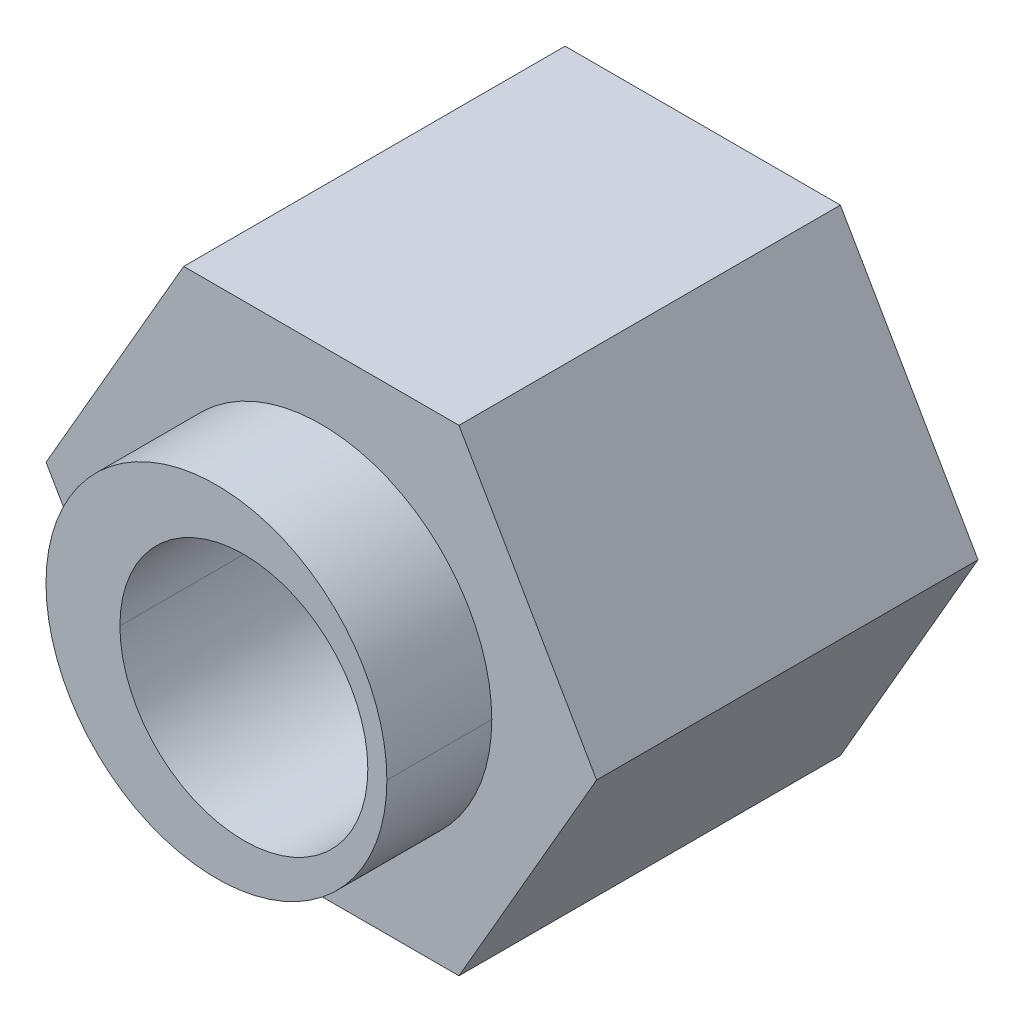
ISO-10303-21;
HEADER;
FILE_DESCRIPTION(('STEP AP214'),'2;1');
FILE_NAME('part.step','',(''),(''),'','','');
FILE_SCHEMA(('AUTOMOTIVE_DESIGN { 1 0 10303 214 1 1 1 1 }'));
ENDSEC;
DATA;
#1=APPLICATION_CONTEXT('core data for automotive mechanical design processes');
#2=APPLICATION_PROTOCOL_DEFINITION('international standard','automotive_design',2000,#1);
#3=PRODUCT_CONTEXT('',#1,'mechanical');
#4=PRODUCT('Part','Part','',(#3));
#5=PRODUCT_RELATED_PRODUCT_CATEGORY('part','',(#4));
#6=PRODUCT_DEFINITION_FORMATION('','',#4);
#7=PRODUCT_DEFINITION_CONTEXT('part definition',#1,'design');
#8=PRODUCT_DEFINITION('design','',#6,#7);
#9=PRODUCT_DEFINITION_SHAPE('','',#8);
#10=(LENGTH_UNIT() NAMED_UNIT(*) SI_UNIT(.MILLI.,.METRE.));
#11=(NAMED_UNIT(*) PLANE_ANGLE_UNIT() SI_UNIT($,.RADIAN.));
#12=(NAMED_UNIT(*) SI_UNIT($,.STERADIAN.) SOLID_ANGLE_UNIT());
#13=UNCERTAINTY_MEASURE_WITH_UNIT(LENGTH_MEASURE(1.E-05),#10,'distance_accuracy_value','');
#14=(GEOMETRIC_REPRESENTATION_CONTEXT(3) GLOBAL_UNCERTAINTY_ASSIGNED_CONTEXT((#13)) GLOBAL_UNIT_ASSIGNED_CONTEXT((#10,
#11,#12)) REPRESENTATION_CONTEXT('',''));
#15=CARTESIAN_POINT('',(0.,0.,0.));
#16=DIRECTION('',(0.,0.,1.));
#17=DIRECTION('',(1.,0.,0.));
#18=AXIS2_PLACEMENT_3D('',#15,#16,#17);
#19=CARTESIAN_POINT('',(0.575,0.,-0.2));
#20=DIRECTION('',(0.,0.,-1.));
#21=DIRECTION('',(-1.,0.,0.));
#22=AXIS2_PLACEMENT_3D('',#19,#20,#21);
#23=CONICAL_SURFACE('',#22,2.6,0.785398163397457);
#24=DIRECTION('',(0.707106781186554,0.,-0.707106781186542));
#25=VECTOR('',#24,1.);
#26=CARTESIAN_POINT('',(3.175,0.,-0.2));
#27=LINE('',#26,#25);
#28=CARTESIAN_POINT('',(3.175,0.,-0.2));
#29=VERTEX_POINT('',#28);
#30=CARTESIAN_POINT('',(3.425,0.,-0.45));
#31=VERTEX_POINT('',#30);
#32=EDGE_CURVE('E295',#29,#31,#27,.T.);
#33=ORIENTED_EDGE('',*,*,#32,.F.);
#34=CARTESIAN_POINT('',(0.575,0.,-0.2));
#35=DIRECTION('',(0.,0.,-1.));
#36=DIRECTION('',(-1.,0.,0.));
#37=AXIS2_PLACEMENT_3D('',#34,#35,#36);
#38=CIRCLE('',#37,2.6);
#39=CARTESIAN_POINT('',(-2.025,0.,-0.2));
#40=VERTEX_POINT('',#39);
#41=EDGE_CURVE('E247',#40,#29,#38,.T.);
#42=ORIENTED_EDGE('',*,*,#41,.F.);
#43=DIRECTION('',(-0.707106781186554,0.,-0.707106781186542));
#44=VECTOR('',#43,1.);
#45=CARTESIAN_POINT('',(-2.025,0.,-0.2));
#46=LINE('',#45,#44);
#47=CARTESIAN_POINT('',(-2.275,0.,-0.45));
#48=VERTEX_POINT('',#47);
#49=EDGE_CURVE('E278',#40,#48,#46,.T.);
#50=ORIENTED_EDGE('',*,*,#49,.T.);
#51=CARTESIAN_POINT('',(0.575,0.,-0.45));
#52=DIRECTION('',(0.,0.,1.));
#53=DIRECTION('',(-1.,0.,0.));
#54=AXIS2_PLACEMENT_3D('',#51,#52,#53);
#55=CIRCLE('',#54,2.85);
#56=EDGE_CURVE('E10',#31,#48,#55,.T.);
#57=ORIENTED_EDGE('',*,*,#56,.F.);
#58=EDGE_LOOP('',(#33,#42,#50,#57));
#59=FACE_BOUND('',#58,.T.);
#60=ADVANCED_FACE('F16',(#59),#23,.F.);
#61=CARTESIAN_POINT('',(0.575,0.,-0.45));
#62=DIRECTION('',(0.,0.,1.));
#63=DIRECTION('',(1.,0.,0.));
#64=AXIS2_PLACEMENT_3D('',#61,#62,#63);
#65=CYLINDRICAL_SURFACE('',#64,3.525);
#66=DIRECTION('',(0.,0.,1.));
#67=VECTOR('',#66,1.);
#68=CARTESIAN_POINT('',(-2.95,0.,-0.45));
#69=LINE('',#68,#67);
#70=CARTESIAN_POINT('',(-2.95,0.,-0.45));
#71=VERTEX_POINT('',#70);
#72=CARTESIAN_POINT('',(-2.95,0.,0.));
#73=VERTEX_POINT('',#72);
#74=EDGE_CURVE('E268',#71,#73,#69,.T.);
#75=ORIENTED_EDGE('',*,*,#74,.F.);
#76=CARTESIAN_POINT('',(0.575,0.,-0.45));
#77=DIRECTION('',(0.,0.,-1.));
#78=DIRECTION('',(-1.,0.,0.));
#79=AXIS2_PLACEMENT_3D('',#76,#77,#78);
#80=CIRCLE('',#79,3.525);
#81=CARTESIAN_POINT('',(4.1,0.,-0.45));
#82=VERTEX_POINT('',#81);
#83=EDGE_CURVE('E20',#82,#71,#80,.T.);
#84=ORIENTED_EDGE('',*,*,#83,.F.);
#85=DIRECTION('',(0.,0.,1.));
#86=VECTOR('',#85,1.);
#87=CARTESIAN_POINT('',(4.1,0.,-0.45));
#88=LINE('',#87,#86);
#89=CARTESIAN_POINT('',(4.1,0.,0.));
#90=VERTEX_POINT('',#89);
#91=EDGE_CURVE('E276',#82,#90,#88,.T.);
#92=ORIENTED_EDGE('',*,*,#91,.T.);
#93=CARTESIAN_POINT('',(0.575,0.,0.));
#94=DIRECTION('',(0.,0.,-1.));
#95=DIRECTION('',(1.,0.,0.));
#96=AXIS2_PLACEMENT_3D('',#93,#94,#95);
#97=CIRCLE('',#96,3.525);
#98=EDGE_CURVE('E213',#90,#73,#97,.T.);
#99=ORIENTED_EDGE('',*,*,#98,.T.);
#100=EDGE_LOOP('',(#75,#84,#92,#99));
#101=FACE_BOUND('',#100,.T.);
#102=ADVANCED_FACE('F18',(#101),#65,.T.);
#103=CARTESIAN_POINT('',(0.575,0.,-0.45));
#104=DIRECTION('',(0.,0.,-1.));
#105=DIRECTION('',(0.,-1.,0.));
#106=AXIS2_PLACEMENT_3D('',#103,#104,#105);
#107=PLANE('',#106);
#108=CARTESIAN_POINT('',(0.575,0.,-0.45));
#109=DIRECTION('',(0.,0.,1.));
#110=DIRECTION('',(-1.,0.,0.));
#111=AXIS2_PLACEMENT_3D('',#108,#109,#110);
#112=CIRCLE('',#111,2.85);
#113=EDGE_CURVE('E284',#48,#31,#112,.T.);
#114=ORIENTED_EDGE('',*,*,#113,.T.);
#115=ORIENTED_EDGE('',*,*,#56,.T.);
#116=EDGE_LOOP('',(#114,#115));
#117=FACE_BOUND('',#116,.T.);
#118=ORIENTED_EDGE('',*,*,#83,.T.);
#119=CARTESIAN_POINT('',(0.575,0.,-0.45));
#120=DIRECTION('',(0.,0.,-1.));
#121=DIRECTION('',(-1.,0.,0.));
#122=AXIS2_PLACEMENT_3D('',#119,#120,#121);
#123=CIRCLE('',#122,3.525);
#124=EDGE_CURVE('E263',#71,#82,#123,.T.);
#125=ORIENTED_EDGE('',*,*,#124,.T.);
#126=EDGE_LOOP('',(#118,#125));
#127=FACE_BOUND('',#126,.T.);
#128=ADVANCED_FACE('F261',(#117,#127),#107,.T.);
#129=CARTESIAN_POINT('',(0.575,0.,-17.));
#130=DIRECTION('',(0.,0.,1.));
#131=DIRECTION('',(1.,0.,0.));
#132=AXIS2_PLACEMENT_3D('',#129,#130,#131);
#133=CYLINDRICAL_SURFACE('',#132,2.6);
#134=DIRECTION('',(0.,0.,1.));
#135=VECTOR('',#134,1.);
#136=CARTESIAN_POINT('',(-2.025,0.,-17.));
#137=LINE('',#136,#135);
#138=CARTESIAN_POINT('',(-2.025,0.,10.2));
#139=VERTEX_POINT('',#138);
#140=EDGE_CURVE('E181',#40,#139,#137,.T.);
#141=ORIENTED_EDGE('',*,*,#140,.F.);
#142=ORIENTED_EDGE('',*,*,#41,.T.);
#143=DIRECTION('',(0.,0.,1.));
#144=VECTOR('',#143,1.);
#145=CARTESIAN_POINT('',(3.175,0.,-17.));
#146=LINE('',#145,#144);
#147=CARTESIAN_POINT('',(3.175,0.,10.2));
#148=VERTEX_POINT('',#147);
#149=EDGE_CURVE('E177',#29,#148,#146,.T.);
#150=ORIENTED_EDGE('',*,*,#149,.T.);
#151=CARTESIAN_POINT('',(0.575,0.,10.2));
#152=DIRECTION('',(0.,0.,1.));
#153=DIRECTION('',(1.,0.,0.));
#154=AXIS2_PLACEMENT_3D('',#151,#152,#153);
#155=CIRCLE('',#154,2.6);
#156=EDGE_CURVE('E245',#148,#139,#155,.T.);
#157=ORIENTED_EDGE('',*,*,#156,.T.);
#158=EDGE_LOOP('',(#141,#142,#150,#157));
#159=FACE_BOUND('',#158,.T.);
#160=ADVANCED_FACE('F313',(#159),#133,.F.);
#161=CARTESIAN_POINT('',(0.,0.,10.2));
#162=DIRECTION('',(0.,0.,1.));
#163=DIRECTION('',(1.,0.,0.));
#164=AXIS2_PLACEMENT_3D('',#161,#162,#163);
#165=PLANE('',#164);
#166=ORIENTED_EDGE('',*,*,#156,.F.);
#167=CARTESIAN_POINT('',(0.575,0.,10.2));
#168=DIRECTION('',(0.,0.,1.));
#169=DIRECTION('',(1.,0.,0.));
#170=AXIS2_PLACEMENT_3D('',#167,#168,#169);
#171=CIRCLE('',#170,2.6);
#172=EDGE_CURVE('E183',#139,#148,#171,.T.);
#173=ORIENTED_EDGE('',*,*,#172,.F.);
#174=EDGE_LOOP('',(#166,#173));
#175=FACE_BOUND('',#174,.T.);
#176=CARTESIAN_POINT('',(0.,0.,10.2));
#177=DIRECTION('',(0.,0.,1.));
#178=DIRECTION('',(1.,0.,0.));
#179=AXIS2_PLACEMENT_3D('',#176,#177,#178);
#180=CIRCLE('',#179,3.575);
#181=CARTESIAN_POINT('',(-3.575,0.,10.2));
#182=VERTEX_POINT('',#181);
#183=CARTESIAN_POINT('',(3.575,0.,10.2));
#184=VERTEX_POINT('',#183);
#185=EDGE_CURVE('E242',#182,#184,#180,.T.);
#186=ORIENTED_EDGE('',*,*,#185,.T.);
#187=CARTESIAN_POINT('',(0.,0.,10.2));
#188=DIRECTION('',(0.,0.,1.));
#189=DIRECTION('',(1.,0.,0.));
#190=AXIS2_PLACEMENT_3D('',#187,#188,#189);
#191=CIRCLE('',#190,3.575);
#192=EDGE_CURVE('E170',#184,#182,#191,.T.);
#193=ORIENTED_EDGE('',*,*,#192,.T.);
#194=EDGE_LOOP('',(#186,#193));
#195=FACE_BOUND('',#194,.T.);
#196=ADVANCED_FACE('F320',(#175,#195),#165,.T.);
#197=CARTESIAN_POINT('',(0.,0.,10.2));
#198=DIRECTION('',(0.,0.,-1.));
#199=DIRECTION('',(-1.,0.,0.));
#200=AXIS2_PLACEMENT_3D('',#197,#198,#199);
#201=CYLINDRICAL_SURFACE('',#200,3.575);
#202=DIRECTION('',(0.,0.,-1.));
#203=VECTOR('',#202,1.);
#204=CARTESIAN_POINT('',(3.575,0.,10.2));
#205=LINE('',#204,#203);
#206=CARTESIAN_POINT('',(3.575,0.,8.));
#207=VERTEX_POINT('',#206);
#208=EDGE_CURVE('E152',#184,#207,#205,.T.);
#209=ORIENTED_EDGE('',*,*,#208,.F.);
#210=ORIENTED_EDGE('',*,*,#185,.F.);
#211=DIRECTION('',(0.,0.,-1.));
#212=VECTOR('',#211,1.);
#213=CARTESIAN_POINT('',(-3.575,0.,10.2));
#214=LINE('',#213,#212);
#215=CARTESIAN_POINT('',(-3.575,0.,8.));
#216=VERTEX_POINT('',#215);
#217=EDGE_CURVE('E155',#182,#216,#214,.T.);
#218=ORIENTED_EDGE('',*,*,#217,.T.);
#219=CARTESIAN_POINT('',(0.,0.,8.));
#220=DIRECTION('',(0.,0.,1.));
#221=DIRECTION('',(1.,0.,0.));
#222=AXIS2_PLACEMENT_3D('',#219,#220,#221);
#223=CIRCLE('',#222,3.575);
#224=EDGE_CURVE('E148',#216,#207,#223,.T.);
#225=ORIENTED_EDGE('',*,*,#224,.T.);
#226=EDGE_LOOP('',(#209,#210,#218,#225));
#227=FACE_BOUND('',#226,.T.);
#228=ADVANCED_FACE('F150',(#227),#201,.T.);
#229=CARTESIAN_POINT('',(-2.88675134594814,-5.,8.));
#230=DIRECTION('',(0.,1.,0.));
#231=DIRECTION('',(1.,0.,0.));
#232=AXIS2_PLACEMENT_3D('',#229,#230,#231);
#233=PLANE('',#232);
#234=DIRECTION('',(1.,0.,0.));
#235=VECTOR('',#234,1.);
#236=CARTESIAN_POINT('',(-2.88675134594814,-5.,0.));
#237=LINE('',#236,#235);
#238=CARTESIAN_POINT('',(-2.88675134594814,-5.,0.));
#239=VERTEX_POINT('',#238);
#240=CARTESIAN_POINT('',(2.88675134594812,-5.,0.));
#241=VERTEX_POINT('',#240);
#242=EDGE_CURVE('E191',#239,#241,#237,.T.);
#243=ORIENTED_EDGE('',*,*,#242,.T.);
#244=DIRECTION('',(0.,0.,-1.));
#245=VECTOR('',#244,1.);
#246=CARTESIAN_POINT('',(2.88675134594812,-5.,8.));
#247=LINE('',#246,#245);
#248=CARTESIAN_POINT('',(2.88675134594812,-5.,8.));
#249=VERTEX_POINT('',#248);
#250=EDGE_CURVE('E233',#249,#241,#247,.T.);
#251=ORIENTED_EDGE('',*,*,#250,.F.);
#252=DIRECTION('',(1.,0.,0.));
#253=VECTOR('',#252,1.);
#254=CARTESIAN_POINT('',(-2.88675134594814,-5.,8.));
#255=LINE('',#254,#253);
#256=CARTESIAN_POINT('',(-2.88675134594814,-5.,8.));
#257=VERTEX_POINT('',#256);
#258=EDGE_CURVE('E160',#257,#249,#255,.T.);
#259=ORIENTED_EDGE('',*,*,#258,.F.);
#260=DIRECTION('',(0.,0.,-1.));
#261=VECTOR('',#260,1.);
#262=CARTESIAN_POINT('',(-2.88675134594814,-5.,8.));
#263=LINE('',#262,#261);
#264=EDGE_CURVE('E39',#257,#239,#263,.T.);
#265=ORIENTED_EDGE('',*,*,#264,.T.);
#266=EDGE_LOOP('',(#243,#251,#259,#265));
#267=FACE_BOUND('',#266,.T.);
#268=ADVANCED_FACE('F328',(#267),#233,.F.);
#269=CARTESIAN_POINT('',(-5.77350269189628,0.,8.));
#270=DIRECTION('',(0.866025403784438,0.5,0.));
#271=DIRECTION('',(0.,0.,-1.));
#272=AXIS2_PLACEMENT_3D('',#269,#270,#271);
#273=PLANE('',#272);
#274=DIRECTION('',(0.5,-0.866025403784438,0.));
#275=VECTOR('',#274,1.);
#276=CARTESIAN_POINT('',(-5.77350269189628,0.,0.));
#277=LINE('',#276,#275);
#278=CARTESIAN_POINT('',(-5.77350269189628,0.,0.));
#279=VERTEX_POINT('',#278);
#280=EDGE_CURVE('E195',#279,#239,#277,.T.);
#281=ORIENTED_EDGE('',*,*,#280,.T.);
#282=ORIENTED_EDGE('',*,*,#264,.F.);
#283=DIRECTION('',(0.5,-0.866025403784438,0.));
#284=VECTOR('',#283,1.);
#285=CARTESIAN_POINT('',(-5.77350269189628,0.,8.));
#286=LINE('',#285,#284);
#287=CARTESIAN_POINT('',(-5.77350269189628,0.,8.));
#288=VERTEX_POINT('',#287);
#289=EDGE_CURVE('E221',#288,#257,#286,.T.);
#290=ORIENTED_EDGE('',*,*,#289,.F.);
#291=DIRECTION('',(0.,0.,-1.));
#292=VECTOR('',#291,1.);
#293=CARTESIAN_POINT('',(-5.77350269189628,0.,8.));
#294=LINE('',#293,#292);
#295=EDGE_CURVE('E50',#288,#279,#294,.T.);
#296=ORIENTED_EDGE('',*,*,#295,.T.);
#297=EDGE_LOOP('',(#281,#282,#290,#296));
#298=FACE_BOUND('',#297,.T.);
#299=ADVANCED_FACE('F360',(#298),#273,.F.);
#300=CARTESIAN_POINT('',(-2.88675134594813,5.,8.));
#301=DIRECTION('',(0.866025403784439,-0.5,0.));
#302=DIRECTION('',(0.,0.,-1.));
#303=AXIS2_PLACEMENT_3D('',#300,#301,#302);
#304=PLANE('',#303);
#305=DIRECTION('',(-0.5,-0.866025403784439,0.));
#306=VECTOR('',#305,1.);
#307=CARTESIAN_POINT('',(-2.88675134594813,5.,0.));
#308=LINE('',#307,#306);
#309=CARTESIAN_POINT('',(-2.88675134594813,5.,0.));
#310=VERTEX_POINT('',#309);
#311=EDGE_CURVE('E198',#310,#279,#308,.T.);
#312=ORIENTED_EDGE('',*,*,#311,.T.);
#313=ORIENTED_EDGE('',*,*,#295,.F.);
#314=DIRECTION('',(-0.5,-0.866025403784439,0.));
#315=VECTOR('',#314,1.);
#316=CARTESIAN_POINT('',(-2.88675134594813,5.,8.));
#317=LINE('',#316,#315);
#318=CARTESIAN_POINT('',(-2.88675134594813,5.,8.));
#319=VERTEX_POINT('',#318);
#320=EDGE_CURVE('E225',#319,#288,#317,.T.);
#321=ORIENTED_EDGE('',*,*,#320,.F.);
#322=DIRECTION('',(0.,0.,-1.));
#323=VECTOR('',#322,1.);
#324=CARTESIAN_POINT('',(-2.88675134594813,5.,8.));
#325=LINE('',#324,#323);
#326=EDGE_CURVE('E199',#319,#310,#325,.T.);
#327=ORIENTED_EDGE('',*,*,#326,.T.);
#328=EDGE_LOOP('',(#312,#313,#321,#327));
#329=FACE_BOUND('',#328,.T.);
#330=ADVANCED_FACE('F353',(#329),#304,.F.);
#331=CARTESIAN_POINT('',(2.88675134594811,5.,8.));
#332=DIRECTION('',(0.,-1.,0.));
#333=DIRECTION('',(0.,0.,-1.));
#334=AXIS2_PLACEMENT_3D('',#331,#332,#333);
#335=PLANE('',#334);
#336=DIRECTION('',(-1.,0.,0.));
#337=VECTOR('',#336,1.);
#338=CARTESIAN_POINT('',(2.88675134594811,5.,0.));
#339=LINE('',#338,#337);
#340=CARTESIAN_POINT('',(2.88675134594811,5.,0.));
#341=VERTEX_POINT('',#340);
#342=EDGE_CURVE('E205',#341,#310,#339,.T.);
#343=ORIENTED_EDGE('',*,*,#342,.T.);
#344=ORIENTED_EDGE('',*,*,#326,.F.);
#345=DIRECTION('',(-1.,0.,0.));
#346=VECTOR('',#345,1.);
#347=CARTESIAN_POINT('',(2.88675134594811,5.,8.));
#348=LINE('',#347,#346);
#349=CARTESIAN_POINT('',(2.88675134594811,5.,8.));
#350=VERTEX_POINT('',#349);
#351=EDGE_CURVE('E229',#350,#319,#348,.T.);
#352=ORIENTED_EDGE('',*,*,#351,.F.);
#353=DIRECTION('',(0.,0.,-1.));
#354=VECTOR('',#353,1.);
#355=CARTESIAN_POINT('',(2.88675134594811,5.,8.));
#356=LINE('',#355,#354);
#357=EDGE_CURVE('E202',#350,#341,#356,.T.);
#358=ORIENTED_EDGE('',*,*,#357,.T.);
#359=EDGE_LOOP('',(#343,#344,#352,#358));
#360=FACE_BOUND('',#359,.T.);
#361=ADVANCED_FACE('F350',(#360),#335,.F.);
#362=CARTESIAN_POINT('',(5.77350269189626,0.,8.));
#363=DIRECTION('',(-0.866025403784439,-0.5,0.));
#364=DIRECTION('',(-0.5,0.866025403784439,0.));
#365=AXIS2_PLACEMENT_3D('',#362,#363,#364);
#366=PLANE('',#365);
#367=DIRECTION('',(-0.5,0.866025403784439,0.));
#368=VECTOR('',#367,1.);
#369=CARTESIAN_POINT('',(5.77350269189626,0.,0.));
#370=LINE('',#369,#368);
#371=CARTESIAN_POINT('',(5.77350269189626,0.,0.));
#372=VERTEX_POINT('',#371);
#373=EDGE_CURVE('E209',#372,#341,#370,.T.);
#374=ORIENTED_EDGE('',*,*,#373,.T.);
#375=ORIENTED_EDGE('',*,*,#357,.F.);
#376=DIRECTION('',(-0.5,0.866025403784439,0.));
#377=VECTOR('',#376,1.);
#378=CARTESIAN_POINT('',(5.77350269189626,0.,8.));
#379=LINE('',#378,#377);
#380=CARTESIAN_POINT('',(5.77350269189626,0.,8.));
#381=VERTEX_POINT('',#380);
#382=EDGE_CURVE('E220',#381,#350,#379,.T.);
#383=ORIENTED_EDGE('',*,*,#382,.F.);
#384=DIRECTION('',(0.,0.,-1.));
#385=VECTOR('',#384,1.);
#386=CARTESIAN_POINT('',(5.77350269189626,0.,8.));
#387=LINE('',#386,#385);
#388=EDGE_CURVE('E159',#381,#372,#387,.T.);
#389=ORIENTED_EDGE('',*,*,#388,.T.);
#390=EDGE_LOOP('',(#374,#375,#383,#389));
#391=FACE_BOUND('',#390,.T.);
#392=ADVANCED_FACE('F345',(#391),#366,.F.);
#393=CARTESIAN_POINT('',(2.88675134594812,-5.,8.));
#394=DIRECTION('',(-0.866025403784439,0.5,0.));
#395=DIRECTION('',(0.,0.,1.));
#396=AXIS2_PLACEMENT_3D('',#393,#394,#395);
#397=PLANE('',#396);
#398=DIRECTION('',(0.5,0.866025403784439,0.));
#399=VECTOR('',#398,1.);
#400=CARTESIAN_POINT('',(2.88675134594812,-5.,0.));
#401=LINE('',#400,#399);
#402=EDGE_CURVE('E187',#241,#372,#401,.T.);
#403=ORIENTED_EDGE('',*,*,#402,.T.);
#404=ORIENTED_EDGE('',*,*,#388,.F.);
#405=DIRECTION('',(0.5,0.866025403784439,0.));
#406=VECTOR('',#405,1.);
#407=CARTESIAN_POINT('',(2.88675134594812,-5.,8.));
#408=LINE('',#407,#406);
#409=EDGE_CURVE('E216',#249,#381,#408,.T.);
#410=ORIENTED_EDGE('',*,*,#409,.F.);
#411=ORIENTED_EDGE('',*,*,#250,.T.);
#412=EDGE_LOOP('',(#403,#404,#410,#411));
#413=FACE_BOUND('',#412,.T.);
#414=ADVANCED_FACE('F342',(#413),#397,.F.);
#415=CARTESIAN_POINT('',(5.77350269189626,0.,8.));
#416=DIRECTION('',(0.,0.,1.));
#417=DIRECTION('',(1.,0.,0.));
#418=AXIS2_PLACEMENT_3D('',#415,#416,#417);
#419=PLANE('',#418);
#420=ORIENTED_EDGE('',*,*,#224,.F.);
#421=CARTESIAN_POINT('',(0.,0.,8.));
#422=DIRECTION('',(0.,0.,1.));
#423=DIRECTION('',(1.,0.,0.));
#424=AXIS2_PLACEMENT_3D('',#421,#422,#423);
#425=CIRCLE('',#424,3.575);
#426=EDGE_CURVE('E162',#207,#216,#425,.T.);
#427=ORIENTED_EDGE('',*,*,#426,.F.);
#428=EDGE_LOOP('',(#420,#427));
#429=FACE_BOUND('',#428,.T.);
#430=ORIENTED_EDGE('',*,*,#409,.T.);
#431=ORIENTED_EDGE('',*,*,#382,.T.);
#432=ORIENTED_EDGE('',*,*,#351,.T.);
#433=ORIENTED_EDGE('',*,*,#320,.T.);
#434=ORIENTED_EDGE('',*,*,#289,.T.);
#435=ORIENTED_EDGE('',*,*,#258,.T.);
#436=EDGE_LOOP('',(#430,#431,#432,#433,#434,#435));
#437=FACE_BOUND('',#436,.T.);
#438=ADVANCED_FACE('F163',(#429,#437),#419,.T.);
#439=CARTESIAN_POINT('',(5.77350269189626,0.,0.));
#440=DIRECTION('',(0.,0.,1.));
#441=DIRECTION('',(1.,0.,0.));
#442=AXIS2_PLACEMENT_3D('',#439,#440,#441);
#443=PLANE('',#442);
#444=ORIENTED_EDGE('',*,*,#98,.F.);
#445=CARTESIAN_POINT('',(0.575,0.,0.));
#446=DIRECTION('',(0.,0.,-1.));
#447=DIRECTION('',(1.,0.,0.));
#448=AXIS2_PLACEMENT_3D('',#445,#446,#447);
#449=CIRCLE('',#448,3.525);
#450=EDGE_CURVE('E273',#73,#90,#449,.T.);
#451=ORIENTED_EDGE('',*,*,#450,.F.);
#452=EDGE_LOOP('',(#444,#451));
#453=FACE_BOUND('',#452,.T.);
#454=ORIENTED_EDGE('',*,*,#402,.F.);
#455=ORIENTED_EDGE('',*,*,#242,.F.);
#456=ORIENTED_EDGE('',*,*,#280,.F.);
#457=ORIENTED_EDGE('',*,*,#311,.F.);
#458=ORIENTED_EDGE('',*,*,#342,.F.);
#459=ORIENTED_EDGE('',*,*,#373,.F.);
#460=EDGE_LOOP('',(#454,#455,#456,#457,#458,#459));
#461=FACE_BOUND('',#460,.T.);
#462=ADVANCED_FACE('F341',(#453,#461),#443,.F.);
#463=CARTESIAN_POINT('',(0.,0.,10.2));
#464=DIRECTION('',(0.,0.,-1.));
#465=DIRECTION('',(-1.,0.,0.));
#466=AXIS2_PLACEMENT_3D('',#463,#464,#465);
#467=CYLINDRICAL_SURFACE('',#466,3.575);
#468=ORIENTED_EDGE('',*,*,#192,.F.);
#469=ORIENTED_EDGE('',*,*,#208,.T.);
#470=ORIENTED_EDGE('',*,*,#426,.T.);
#471=ORIENTED_EDGE('',*,*,#217,.F.);
#472=EDGE_LOOP('',(#468,#469,#470,#471));
#473=FACE_BOUND('',#472,.T.);
#474=ADVANCED_FACE('F168',(#473),#467,.T.);
#475=CARTESIAN_POINT('',(0.575,0.,-17.));
#476=DIRECTION('',(0.,0.,1.));
#477=DIRECTION('',(1.,0.,0.));
#478=AXIS2_PLACEMENT_3D('',#475,#476,#477);
#479=CYLINDRICAL_SURFACE('',#478,2.6);
#480=CARTESIAN_POINT('',(0.575,0.,-0.2));
#481=DIRECTION('',(0.,0.,-1.));
#482=DIRECTION('',(-1.,0.,0.));
#483=AXIS2_PLACEMENT_3D('',#480,#481,#482);
#484=CIRCLE('',#483,2.6);
#485=EDGE_CURVE('E291',#29,#40,#484,.T.);
#486=ORIENTED_EDGE('',*,*,#485,.T.);
#487=ORIENTED_EDGE('',*,*,#140,.T.);
#488=ORIENTED_EDGE('',*,*,#172,.T.);
#489=ORIENTED_EDGE('',*,*,#149,.F.);
#490=EDGE_LOOP('',(#486,#487,#488,#489));
#491=FACE_BOUND('',#490,.T.);
#492=ADVANCED_FACE('F318',(#491),#479,.F.);
#493=CARTESIAN_POINT('',(0.575,0.,-0.45));
#494=DIRECTION('',(0.,0.,1.));
#495=DIRECTION('',(1.,0.,0.));
#496=AXIS2_PLACEMENT_3D('',#493,#494,#495);
#497=CYLINDRICAL_SURFACE('',#496,3.525);
#498=ORIENTED_EDGE('',*,*,#124,.F.);
#499=ORIENTED_EDGE('',*,*,#74,.T.);
#500=ORIENTED_EDGE('',*,*,#450,.T.);
#501=ORIENTED_EDGE('',*,*,#91,.F.);
#502=EDGE_LOOP('',(#498,#499,#500,#501));
#503=FACE_BOUND('',#502,.T.);
#504=ADVANCED_FACE('F275',(#503),#497,.T.);
#505=CARTESIAN_POINT('',(0.575,0.,-0.2));
#506=DIRECTION('',(0.,0.,-1.));
#507=DIRECTION('',(-1.,0.,0.));
#508=AXIS2_PLACEMENT_3D('',#505,#506,#507);
#509=CONICAL_SURFACE('',#508,2.6,0.785398163397457);
#510=ORIENTED_EDGE('',*,*,#485,.F.);
#511=ORIENTED_EDGE('',*,*,#32,.T.);
#512=ORIENTED_EDGE('',*,*,#113,.F.);
#513=ORIENTED_EDGE('',*,*,#49,.F.);
#514=EDGE_LOOP('',(#510,#511,#512,#513));
#515=FACE_BOUND('',#514,.T.);
#516=ADVANCED_FACE('F388',(#515),#509,.F.);
#517=CLOSED_SHELL('',(#60,#102,#128,#160,#196,#228,#268,#299,#330,#361,#392,#414,#438,#462,#474,
#492,#504,#516));
#518=MANIFOLD_SOLID_BREP('B1',#517);
#519=ADVANCED_BREP_SHAPE_REPRESENTATION('',(#18,#518),#14);
#520=SHAPE_DEFINITION_REPRESENTATION(#9,#519);
ENDSEC;
END-ISO-10303-21;
